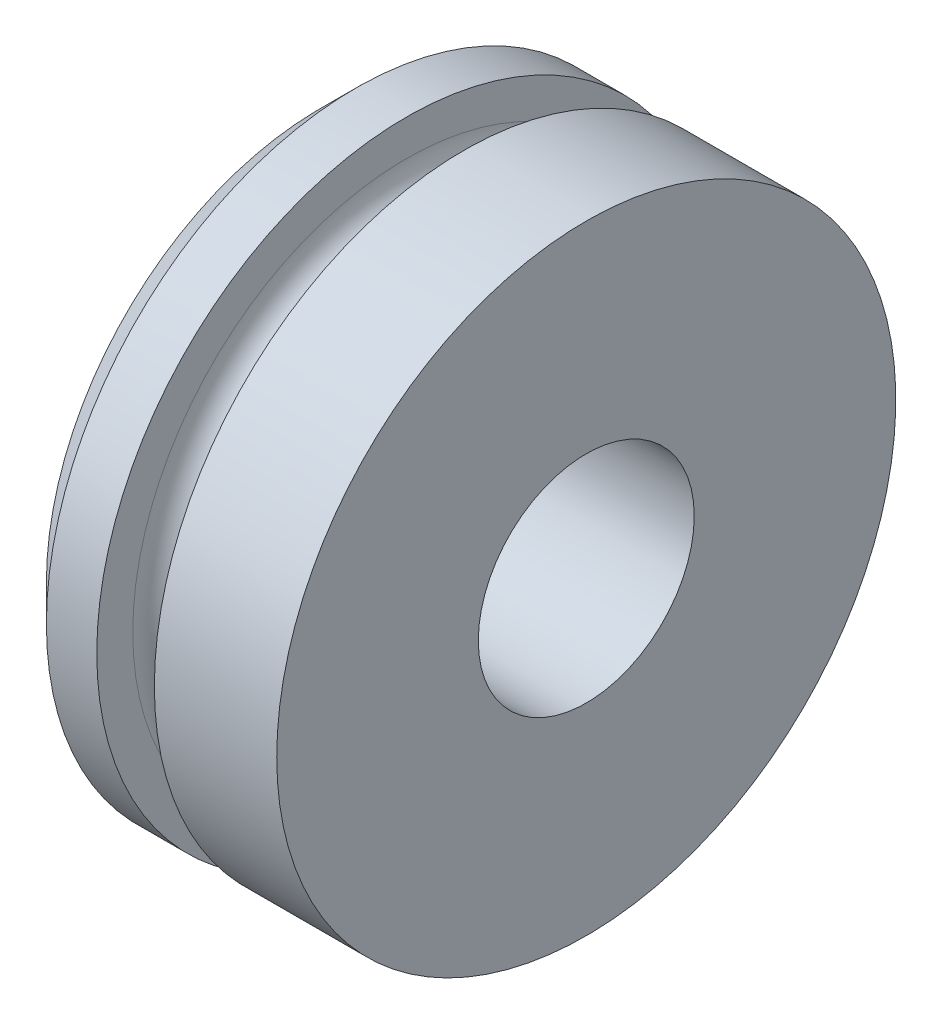
ISO-10303-21;
HEADER;
FILE_DESCRIPTION(('STEP AP214'),'2;1');
FILE_NAME('part.step','',(''),(''),'','','');
FILE_SCHEMA(('AUTOMOTIVE_DESIGN { 1 0 10303 214 1 1 1 1 }'));
ENDSEC;
DATA;
#1=APPLICATION_CONTEXT('core data for automotive mechanical design processes');
#2=APPLICATION_PROTOCOL_DEFINITION('international standard','automotive_design',2000,#1);
#3=PRODUCT_CONTEXT('',#1,'mechanical');
#4=PRODUCT('Part','Part','',(#3));
#5=PRODUCT_RELATED_PRODUCT_CATEGORY('part','',(#4));
#6=PRODUCT_DEFINITION_FORMATION('','',#4);
#7=PRODUCT_DEFINITION_CONTEXT('part definition',#1,'design');
#8=PRODUCT_DEFINITION('design','',#6,#7);
#9=PRODUCT_DEFINITION_SHAPE('','',#8);
#10=(LENGTH_UNIT() NAMED_UNIT(*) SI_UNIT(.MILLI.,.METRE.));
#11=(NAMED_UNIT(*) PLANE_ANGLE_UNIT() SI_UNIT($,.RADIAN.));
#12=(NAMED_UNIT(*) SI_UNIT($,.STERADIAN.) SOLID_ANGLE_UNIT());
#13=UNCERTAINTY_MEASURE_WITH_UNIT(LENGTH_MEASURE(1.E-05),#10,'distance_accuracy_value','');
#14=(GEOMETRIC_REPRESENTATION_CONTEXT(3) GLOBAL_UNCERTAINTY_ASSIGNED_CONTEXT((#13)) GLOBAL_UNIT_ASSIGNED_CONTEXT((#10,
#11,#12)) REPRESENTATION_CONTEXT('',''));
#15=CARTESIAN_POINT('',(0.,0.,0.));
#16=DIRECTION('',(0.,0.,1.));
#17=DIRECTION('',(1.,0.,0.));
#18=AXIS2_PLACEMENT_3D('',#15,#16,#17);
#19=CARTESIAN_POINT('',(10.16,0.,0.));
#20=DIRECTION('',(-1.,0.,0.));
#21=DIRECTION('',(0.,0.,1.));
#22=AXIS2_PLACEMENT_3D('',#19,#20,#21);
#23=TOROIDAL_SURFACE('',#22,24.13,2.54);
#24=CARTESIAN_POINT('',(12.7,0.,0.));
#25=DIRECTION('',(-1.,0.,0.));
#26=DIRECTION('',(0.,0.,1.));
#27=AXIS2_PLACEMENT_3D('',#24,#25,#26);
#28=CIRCLE('',#27,24.13);
#29=CARTESIAN_POINT('',(12.7,0.,24.13));
#30=VERTEX_POINT('',#29);
#31=EDGE_CURVE('E72',#30,#30,#28,.T.);
#32=ORIENTED_EDGE('',*,*,#31,.T.);
#33=EDGE_LOOP('',(#32));
#34=FACE_BOUND('',#33,.T.);
#35=CARTESIAN_POINT('',(7.62,0.,0.));
#36=DIRECTION('',(-1.,0.,0.));
#37=DIRECTION('',(0.,0.,1.));
#38=AXIS2_PLACEMENT_3D('',#35,#36,#37);
#39=CIRCLE('',#38,24.13);
#40=CARTESIAN_POINT('',(7.62,0.,24.13));
#41=VERTEX_POINT('',#40);
#42=EDGE_CURVE('E51',#41,#41,#39,.T.);
#43=ORIENTED_EDGE('',*,*,#42,.F.);
#44=EDGE_LOOP('',(#43));
#45=FACE_BOUND('',#44,.T.);
#46=ADVANCED_FACE('F39',(#34,#45),#23,.F.);
#47=CARTESIAN_POINT('',(7.62,0.,0.));
#48=DIRECTION('',(-1.,0.,0.));
#49=DIRECTION('',(0.,0.,1.));
#50=AXIS2_PLACEMENT_3D('',#47,#48,#49);
#51=PLANE('',#50);
#52=CARTESIAN_POINT('',(7.62,0.,0.));
#53=DIRECTION('',(-1.,0.,0.));
#54=DIRECTION('',(0.,0.,1.));
#55=AXIS2_PLACEMENT_3D('',#52,#53,#54);
#56=CIRCLE('',#55,27.305);
#57=CARTESIAN_POINT('',(7.62,0.,27.305));
#58=VERTEX_POINT('',#57);
#59=EDGE_CURVE('E55',#58,#58,#56,.T.);
#60=ORIENTED_EDGE('',*,*,#59,.F.);
#61=EDGE_LOOP('',(#60));
#62=FACE_BOUND('',#61,.T.);
#63=ORIENTED_EDGE('',*,*,#42,.T.);
#64=EDGE_LOOP('',(#63));
#65=FACE_BOUND('',#64,.T.);
#66=ADVANCED_FACE('F92',(#62,#65),#51,.F.);
#67=CARTESIAN_POINT('',(0.,0.,0.));
#68=DIRECTION('',(-1.,0.,0.));
#69=DIRECTION('',(0.,0.,1.));
#70=AXIS2_PLACEMENT_3D('',#67,#68,#69);
#71=CYLINDRICAL_SURFACE('',#70,27.305);
#72=CARTESIAN_POINT('',(3.17500000000001,0.,0.));
#73=DIRECTION('',(-1.,0.,0.));
#74=DIRECTION('',(0.,0.,1.));
#75=AXIS2_PLACEMENT_3D('',#72,#73,#74);
#76=CIRCLE('',#75,27.305);
#77=CARTESIAN_POINT('',(3.17500000000001,0.,27.305));
#78=VERTEX_POINT('',#77);
#79=EDGE_CURVE('E10',#78,#78,#76,.F.);
#80=ORIENTED_EDGE('',*,*,#79,.T.);
#81=EDGE_LOOP('',(#80));
#82=FACE_BOUND('',#81,.T.);
#83=ORIENTED_EDGE('',*,*,#59,.T.);
#84=EDGE_LOOP('',(#83));
#85=FACE_BOUND('',#84,.T.);
#86=ADVANCED_FACE('F96',(#82,#85),#71,.T.);
#87=CARTESIAN_POINT('',(0.,0.,0.));
#88=DIRECTION('',(-1.,0.,0.));
#89=DIRECTION('',(0.,0.,1.));
#90=AXIS2_PLACEMENT_3D('',#87,#88,#89);
#91=PLANE('',#90);
#92=CARTESIAN_POINT('',(0.,0.,0.));
#93=DIRECTION('',(-1.,0.,0.));
#94=DIRECTION('',(0.,0.,1.));
#95=AXIS2_PLACEMENT_3D('',#92,#93,#94);
#96=CIRCLE('',#95,24.13);
#97=CARTESIAN_POINT('',(0.,0.,24.13));
#98=VERTEX_POINT('',#97);
#99=EDGE_CURVE('E47',#98,#98,#96,.T.);
#100=ORIENTED_EDGE('',*,*,#99,.T.);
#101=EDGE_LOOP('',(#100));
#102=FACE_BOUND('',#101,.T.);
#103=CARTESIAN_POINT('',(0.,0.,0.));
#104=DIRECTION('',(-1.,0.,0.));
#105=DIRECTION('',(0.,0.,1.));
#106=AXIS2_PLACEMENT_3D('',#103,#104,#105);
#107=CIRCLE('',#106,9.525);
#108=CARTESIAN_POINT('',(0.,0.,9.525));
#109=VERTEX_POINT('',#108);
#110=EDGE_CURVE('E60',#109,#109,#107,.T.);
#111=ORIENTED_EDGE('',*,*,#110,.F.);
#112=EDGE_LOOP('',(#111));
#113=FACE_BOUND('',#112,.T.);
#114=ADVANCED_FACE('F102',(#102,#113),#91,.T.);
#115=CARTESIAN_POINT('',(0.,0.,0.));
#116=DIRECTION('',(-1.,0.,0.));
#117=DIRECTION('',(0.,0.,1.));
#118=AXIS2_PLACEMENT_3D('',#115,#116,#117);
#119=CYLINDRICAL_SURFACE('',#118,9.525);
#120=CARTESIAN_POINT('',(23.495,0.,0.));
#121=DIRECTION('',(-1.,0.,0.));
#122=DIRECTION('',(0.,0.,1.));
#123=AXIS2_PLACEMENT_3D('',#120,#121,#122);
#124=CIRCLE('',#123,9.525);
#125=CARTESIAN_POINT('',(23.495,0.,9.525));
#126=VERTEX_POINT('',#125);
#127=EDGE_CURVE('E63',#126,#126,#124,.T.);
#128=ORIENTED_EDGE('',*,*,#127,.F.);
#129=EDGE_LOOP('',(#128));
#130=FACE_BOUND('',#129,.T.);
#131=ORIENTED_EDGE('',*,*,#110,.T.);
#132=EDGE_LOOP('',(#131));
#133=FACE_BOUND('',#132,.T.);
#134=ADVANCED_FACE('F105',(#130,#133),#119,.F.);
#135=CARTESIAN_POINT('',(23.495,0.,0.));
#136=DIRECTION('',(-1.,0.,0.));
#137=DIRECTION('',(0.,0.,1.));
#138=AXIS2_PLACEMENT_3D('',#135,#136,#137);
#139=PLANE('',#138);
#140=CARTESIAN_POINT('',(23.495,0.,0.));
#141=DIRECTION('',(-1.,0.,0.));
#142=DIRECTION('',(0.,0.,1.));
#143=AXIS2_PLACEMENT_3D('',#140,#141,#142);
#144=CIRCLE('',#143,27.305);
#145=CARTESIAN_POINT('',(23.495,0.,27.305));
#146=VERTEX_POINT('',#145);
#147=EDGE_CURVE('E66',#146,#146,#144,.T.);
#148=ORIENTED_EDGE('',*,*,#147,.F.);
#149=EDGE_LOOP('',(#148));
#150=FACE_BOUND('',#149,.T.);
#151=ORIENTED_EDGE('',*,*,#127,.T.);
#152=EDGE_LOOP('',(#151));
#153=FACE_BOUND('',#152,.T.);
#154=ADVANCED_FACE('F88',(#150,#153),#139,.F.);
#155=CARTESIAN_POINT('',(0.,0.,0.));
#156=DIRECTION('',(-1.,0.,0.));
#157=DIRECTION('',(0.,0.,1.));
#158=AXIS2_PLACEMENT_3D('',#155,#156,#157);
#159=CYLINDRICAL_SURFACE('',#158,27.305);
#160=ORIENTED_EDGE('',*,*,#147,.T.);
#161=EDGE_LOOP('',(#160));
#162=FACE_BOUND('',#161,.T.);
#163=CARTESIAN_POINT('',(12.7,0.,0.));
#164=DIRECTION('',(-1.,0.,0.));
#165=DIRECTION('',(0.,0.,1.));
#166=AXIS2_PLACEMENT_3D('',#163,#164,#165);
#167=CIRCLE('',#166,27.305);
#168=CARTESIAN_POINT('',(12.7,0.,27.305));
#169=VERTEX_POINT('',#168);
#170=EDGE_CURVE('E69',#169,#169,#167,.T.);
#171=ORIENTED_EDGE('',*,*,#170,.F.);
#172=EDGE_LOOP('',(#171));
#173=FACE_BOUND('',#172,.T.);
#174=ADVANCED_FACE('F80',(#162,#173),#159,.T.);
#175=CARTESIAN_POINT('',(12.7,0.,0.));
#176=DIRECTION('',(-1.,0.,0.));
#177=DIRECTION('',(0.,0.,1.));
#178=AXIS2_PLACEMENT_3D('',#175,#176,#177);
#179=PLANE('',#178);
#180=ORIENTED_EDGE('',*,*,#170,.T.);
#181=EDGE_LOOP('',(#180));
#182=FACE_BOUND('',#181,.T.);
#183=ORIENTED_EDGE('',*,*,#31,.F.);
#184=EDGE_LOOP('',(#183));
#185=FACE_BOUND('',#184,.T.);
#186=ADVANCED_FACE('F78',(#182,#185),#179,.T.);
#187=CARTESIAN_POINT('',(0.,0.,0.));
#188=DIRECTION('',(1.,0.,0.));
#189=DIRECTION('',(0.,0.,-1.));
#190=AXIS2_PLACEMENT_3D('',#187,#188,#189);
#191=CONICAL_SURFACE('',#190,24.13,0.785398163397446);
#192=ORIENTED_EDGE('',*,*,#79,.F.);
#193=EDGE_LOOP('',(#192));
#194=FACE_BOUND('',#193,.T.);
#195=ORIENTED_EDGE('',*,*,#99,.F.);
#196=EDGE_LOOP('',(#195));
#197=FACE_BOUND('',#196,.T.);
#198=ADVANCED_FACE('F42',(#194,#197),#191,.T.);
#199=CLOSED_SHELL('',(#46,#66,#86,#114,#134,#154,#174,#186,#198));
#200=MANIFOLD_SOLID_BREP('B2',#199);
#201=ADVANCED_BREP_SHAPE_REPRESENTATION('',(#18,#200),#14);
#202=SHAPE_DEFINITION_REPRESENTATION(#9,#201);
ENDSEC;
END-ISO-10303-21;
